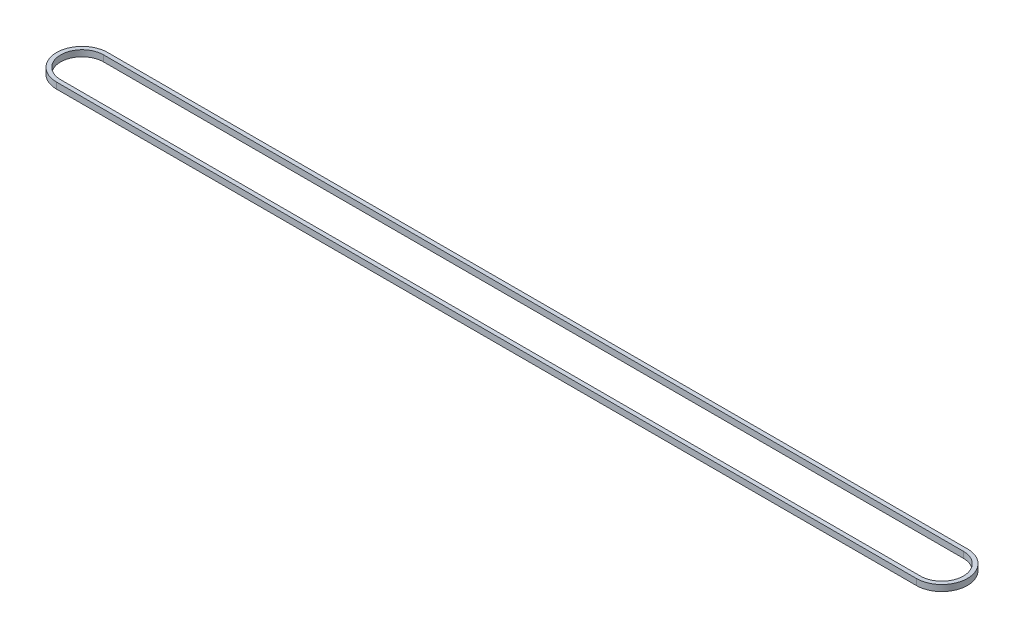
ISO-10303-21;
HEADER;
FILE_DESCRIPTION(('STEP AP214'),'2;1');
FILE_NAME('part.step','',(''),(''),'','','');
FILE_SCHEMA(('AUTOMOTIVE_DESIGN { 1 0 10303 214 1 1 1 1 }'));
ENDSEC;
DATA;
#1=APPLICATION_CONTEXT('core data for automotive mechanical design processes');
#2=APPLICATION_PROTOCOL_DEFINITION('international standard','automotive_design',2000,#1);
#3=PRODUCT_CONTEXT('',#1,'mechanical');
#4=PRODUCT('Part','Part','',(#3));
#5=PRODUCT_RELATED_PRODUCT_CATEGORY('part','',(#4));
#6=PRODUCT_DEFINITION_FORMATION('','',#4);
#7=PRODUCT_DEFINITION_CONTEXT('part definition',#1,'design');
#8=PRODUCT_DEFINITION('design','',#6,#7);
#9=PRODUCT_DEFINITION_SHAPE('','',#8);
#10=(LENGTH_UNIT() NAMED_UNIT(*) SI_UNIT(.MILLI.,.METRE.));
#11=(NAMED_UNIT(*) PLANE_ANGLE_UNIT() SI_UNIT($,.RADIAN.));
#12=(NAMED_UNIT(*) SI_UNIT($,.STERADIAN.) SOLID_ANGLE_UNIT());
#13=UNCERTAINTY_MEASURE_WITH_UNIT(LENGTH_MEASURE(1.E-05),#10,'distance_accuracy_value','');
#14=(GEOMETRIC_REPRESENTATION_CONTEXT(3) GLOBAL_UNCERTAINTY_ASSIGNED_CONTEXT((#13)) GLOBAL_UNIT_ASSIGNED_CONTEXT((#10,
#11,#12)) REPRESENTATION_CONTEXT('',''));
#15=CARTESIAN_POINT('',(0.,0.,0.));
#16=DIRECTION('',(0.,0.,1.));
#17=DIRECTION('',(1.,0.,0.));
#18=AXIS2_PLACEMENT_3D('',#15,#16,#17);
#19=CARTESIAN_POINT('',(-32.6689284068016,3.,0.));
#20=DIRECTION('',(0.,1.,0.));
#21=DIRECTION('',(0.,0.,1.));
#22=AXIS2_PLACEMENT_3D('',#19,#20,#21);
#23=PLANE('',#22);
#24=CARTESIAN_POINT('',(-32.6689284068016,3.,0.));
#25=DIRECTION('',(0.,1.,0.));
#26=DIRECTION('',(0.,0.,1.));
#27=AXIS2_PLACEMENT_3D('',#24,#25,#26);
#28=CIRCLE('',#27,12.5);
#29=CARTESIAN_POINT('',(-32.6689284068016,3.,-12.5));
#30=VERTEX_POINT('',#29);
#31=CARTESIAN_POINT('',(-32.6689284068016,3.,12.5));
#32=VERTEX_POINT('',#31);
#33=EDGE_CURVE('E134',#30,#32,#28,.T.);
#34=ORIENTED_EDGE('',*,*,#33,.T.);
#35=DIRECTION('',(1.,0.,0.));
#36=VECTOR('',#35,1.);
#37=CARTESIAN_POINT('',(-32.6689284068016,3.,12.5));
#38=LINE('',#37,#36);
#39=CARTESIAN_POINT('',(387.331071593198,3.,12.5));
#40=VERTEX_POINT('',#39);
#41=EDGE_CURVE('E137',#32,#40,#38,.T.);
#42=ORIENTED_EDGE('',*,*,#41,.T.);
#43=CARTESIAN_POINT('',(387.331071593198,3.,0.));
#44=DIRECTION('',(0.,1.,0.));
#45=DIRECTION('',(0.,0.,1.));
#46=AXIS2_PLACEMENT_3D('',#43,#44,#45);
#47=CIRCLE('',#46,12.5);
#48=CARTESIAN_POINT('',(387.331071593198,3.,-12.5));
#49=VERTEX_POINT('',#48);
#50=EDGE_CURVE('E140',#40,#49,#47,.T.);
#51=ORIENTED_EDGE('',*,*,#50,.T.);
#52=DIRECTION('',(-1.,0.,0.));
#53=VECTOR('',#52,1.);
#54=CARTESIAN_POINT('',(-32.6689284068016,3.,-12.5));
#55=LINE('',#54,#53);
#56=EDGE_CURVE('E142',#49,#30,#55,.T.);
#57=ORIENTED_EDGE('',*,*,#56,.T.);
#58=EDGE_LOOP('',(#34,#42,#51,#57));
#59=FACE_BOUND('',#58,.T.);
#60=DIRECTION('',(1.,0.,0.));
#61=VECTOR('',#60,1.);
#62=CARTESIAN_POINT('',(-32.6689284068016,3.,10.5));
#63=LINE('',#62,#61);
#64=CARTESIAN_POINT('',(-32.6689284068016,3.,10.5));
#65=VERTEX_POINT('',#64);
#66=CARTESIAN_POINT('',(387.331071593198,3.,10.5));
#67=VERTEX_POINT('',#66);
#68=EDGE_CURVE('E106',#65,#67,#63,.T.);
#69=ORIENTED_EDGE('',*,*,#68,.F.);
#70=CARTESIAN_POINT('',(-32.6689284068016,3.,0.));
#71=DIRECTION('',(0.,1.,0.));
#72=DIRECTION('',(0.,0.,1.));
#73=AXIS2_PLACEMENT_3D('',#70,#71,#72);
#74=CIRCLE('',#73,10.5);
#75=CARTESIAN_POINT('',(-32.6689284068016,3.,-10.5));
#76=VERTEX_POINT('',#75);
#77=EDGE_CURVE('E98',#76,#65,#74,.T.);
#78=ORIENTED_EDGE('',*,*,#77,.F.);
#79=DIRECTION('',(-1.,0.,0.));
#80=VECTOR('',#79,1.);
#81=CARTESIAN_POINT('',(-32.6689284068016,3.,-10.5));
#82=LINE('',#81,#80);
#83=CARTESIAN_POINT('',(387.331071593198,3.,-10.5));
#84=VERTEX_POINT('',#83);
#85=EDGE_CURVE('E120',#84,#76,#82,.T.);
#86=ORIENTED_EDGE('',*,*,#85,.F.);
#87=CARTESIAN_POINT('',(387.331071593198,3.,0.));
#88=DIRECTION('',(0.,1.,0.));
#89=DIRECTION('',(0.,0.,1.));
#90=AXIS2_PLACEMENT_3D('',#87,#88,#89);
#91=CIRCLE('',#90,10.5);
#92=EDGE_CURVE('E118',#67,#84,#91,.T.);
#93=ORIENTED_EDGE('',*,*,#92,.F.);
#94=EDGE_LOOP('',(#69,#78,#86,#93));
#95=FACE_BOUND('',#94,.T.);
#96=ADVANCED_FACE('F33',(#59,#95),#23,.T.);
#97=CARTESIAN_POINT('',(-32.6689284068016,0.,0.));
#98=DIRECTION('',(0.,1.,0.));
#99=DIRECTION('',(0.,0.,1.));
#100=AXIS2_PLACEMENT_3D('',#97,#98,#99);
#101=PLANE('',#100);
#102=CARTESIAN_POINT('',(-32.6689284068016,0.,0.));
#103=DIRECTION('',(0.,1.,0.));
#104=DIRECTION('',(0.,0.,1.));
#105=AXIS2_PLACEMENT_3D('',#102,#103,#104);
#106=CIRCLE('',#105,12.5);
#107=CARTESIAN_POINT('',(-32.6689284068016,0.,-12.5));
#108=VERTEX_POINT('',#107);
#109=CARTESIAN_POINT('',(-32.6689284068016,0.,12.5));
#110=VERTEX_POINT('',#109);
#111=EDGE_CURVE('E114',#108,#110,#106,.T.);
#112=ORIENTED_EDGE('',*,*,#111,.F.);
#113=DIRECTION('',(-1.,0.,0.));
#114=VECTOR('',#113,1.);
#115=CARTESIAN_POINT('',(-32.6689284068016,0.,-12.5));
#116=LINE('',#115,#114);
#117=CARTESIAN_POINT('',(387.331071593198,0.,-12.5));
#118=VERTEX_POINT('',#117);
#119=EDGE_CURVE('E138',#118,#108,#116,.T.);
#120=ORIENTED_EDGE('',*,*,#119,.F.);
#121=CARTESIAN_POINT('',(387.331071593198,0.,0.));
#122=DIRECTION('',(0.,1.,0.));
#123=DIRECTION('',(0.,0.,1.));
#124=AXIS2_PLACEMENT_3D('',#121,#122,#123);
#125=CIRCLE('',#124,12.5);
#126=CARTESIAN_POINT('',(387.331071593198,0.,12.5));
#127=VERTEX_POINT('',#126);
#128=EDGE_CURVE('E149',#127,#118,#125,.T.);
#129=ORIENTED_EDGE('',*,*,#128,.F.);
#130=DIRECTION('',(1.,0.,0.));
#131=VECTOR('',#130,1.);
#132=CARTESIAN_POINT('',(-32.6689284068016,0.,12.5));
#133=LINE('',#132,#131);
#134=EDGE_CURVE('E147',#110,#127,#133,.T.);
#135=ORIENTED_EDGE('',*,*,#134,.F.);
#136=EDGE_LOOP('',(#112,#120,#129,#135));
#137=FACE_BOUND('',#136,.T.);
#138=CARTESIAN_POINT('',(-32.6689284068016,0.,0.));
#139=DIRECTION('',(0.,1.,0.));
#140=DIRECTION('',(0.,0.,1.));
#141=AXIS2_PLACEMENT_3D('',#138,#139,#140);
#142=CIRCLE('',#141,10.5);
#143=CARTESIAN_POINT('',(-32.6689284068016,0.,-10.5));
#144=VERTEX_POINT('',#143);
#145=CARTESIAN_POINT('',(-32.6689284068016,0.,10.5));
#146=VERTEX_POINT('',#145);
#147=EDGE_CURVE('E56',#144,#146,#142,.T.);
#148=ORIENTED_EDGE('',*,*,#147,.T.);
#149=DIRECTION('',(1.,0.,0.));
#150=VECTOR('',#149,1.);
#151=CARTESIAN_POINT('',(-32.6689284068016,0.,10.5));
#152=LINE('',#151,#150);
#153=CARTESIAN_POINT('',(387.331071593198,0.,10.5));
#154=VERTEX_POINT('',#153);
#155=EDGE_CURVE('E113',#146,#154,#152,.T.);
#156=ORIENTED_EDGE('',*,*,#155,.T.);
#157=CARTESIAN_POINT('',(387.331071593198,0.,0.));
#158=DIRECTION('',(0.,1.,0.));
#159=DIRECTION('',(0.,0.,1.));
#160=AXIS2_PLACEMENT_3D('',#157,#158,#159);
#161=CIRCLE('',#160,10.5);
#162=CARTESIAN_POINT('',(387.331071593198,0.,-10.5));
#163=VERTEX_POINT('',#162);
#164=EDGE_CURVE('E126',#154,#163,#161,.T.);
#165=ORIENTED_EDGE('',*,*,#164,.T.);
#166=DIRECTION('',(-1.,0.,0.));
#167=VECTOR('',#166,1.);
#168=CARTESIAN_POINT('',(-32.6689284068016,0.,-10.5));
#169=LINE('',#168,#167);
#170=EDGE_CURVE('E107',#163,#144,#169,.T.);
#171=ORIENTED_EDGE('',*,*,#170,.T.);
#172=EDGE_LOOP('',(#148,#156,#165,#171));
#173=FACE_BOUND('',#172,.T.);
#174=ADVANCED_FACE('F167',(#137,#173),#101,.F.);
#175=CARTESIAN_POINT('',(-32.6689284068016,3.,0.));
#176=DIRECTION('',(0.,-1.,0.));
#177=DIRECTION('',(0.,0.,-1.));
#178=AXIS2_PLACEMENT_3D('',#175,#176,#177);
#179=CYLINDRICAL_SURFACE('',#178,12.5);
#180=ORIENTED_EDGE('',*,*,#111,.T.);
#181=DIRECTION('',(0.,-1.,0.));
#182=VECTOR('',#181,1.);
#183=CARTESIAN_POINT('',(-32.6689284068016,3.,12.5));
#184=LINE('',#183,#182);
#185=EDGE_CURVE('E11',#32,#110,#184,.T.);
#186=ORIENTED_EDGE('',*,*,#185,.F.);
#187=ORIENTED_EDGE('',*,*,#33,.F.);
#188=DIRECTION('',(0.,-1.,0.));
#189=VECTOR('',#188,1.);
#190=CARTESIAN_POINT('',(-32.6689284068016,3.,-12.5));
#191=LINE('',#190,#189);
#192=EDGE_CURVE('E144',#30,#108,#191,.T.);
#193=ORIENTED_EDGE('',*,*,#192,.T.);
#194=EDGE_LOOP('',(#180,#186,#187,#193));
#195=FACE_BOUND('',#194,.T.);
#196=ADVANCED_FACE('F35',(#195),#179,.T.);
#197=CARTESIAN_POINT('',(-32.6689284068016,3.,12.5));
#198=DIRECTION('',(0.,0.,-1.));
#199=DIRECTION('',(-1.,0.,0.));
#200=AXIS2_PLACEMENT_3D('',#197,#198,#199);
#201=PLANE('',#200);
#202=ORIENTED_EDGE('',*,*,#134,.T.);
#203=DIRECTION('',(0.,-1.,0.));
#204=VECTOR('',#203,1.);
#205=CARTESIAN_POINT('',(387.331071593198,3.,12.5));
#206=LINE('',#205,#204);
#207=EDGE_CURVE('E41',#40,#127,#206,.T.);
#208=ORIENTED_EDGE('',*,*,#207,.F.);
#209=ORIENTED_EDGE('',*,*,#41,.F.);
#210=ORIENTED_EDGE('',*,*,#185,.T.);
#211=EDGE_LOOP('',(#202,#208,#209,#210));
#212=FACE_BOUND('',#211,.T.);
#213=ADVANCED_FACE('F177',(#212),#201,.F.);
#214=CARTESIAN_POINT('',(387.331071593198,3.,0.));
#215=DIRECTION('',(0.,-1.,0.));
#216=DIRECTION('',(0.,0.,-1.));
#217=AXIS2_PLACEMENT_3D('',#214,#215,#216);
#218=CYLINDRICAL_SURFACE('',#217,12.5);
#219=ORIENTED_EDGE('',*,*,#128,.T.);
#220=DIRECTION('',(0.,-1.,0.));
#221=VECTOR('',#220,1.);
#222=CARTESIAN_POINT('',(387.331071593198,3.,-12.5));
#223=LINE('',#222,#221);
#224=EDGE_CURVE('E154',#49,#118,#223,.T.);
#225=ORIENTED_EDGE('',*,*,#224,.F.);
#226=ORIENTED_EDGE('',*,*,#50,.F.);
#227=ORIENTED_EDGE('',*,*,#207,.T.);
#228=EDGE_LOOP('',(#219,#225,#226,#227));
#229=FACE_BOUND('',#228,.T.);
#230=ADVANCED_FACE('F161',(#229),#218,.T.);
#231=CARTESIAN_POINT('',(-32.6689284068016,3.,-12.5));
#232=DIRECTION('',(0.,0.,1.));
#233=DIRECTION('',(1.,0.,0.));
#234=AXIS2_PLACEMENT_3D('',#231,#232,#233);
#235=PLANE('',#234);
#236=ORIENTED_EDGE('',*,*,#119,.T.);
#237=ORIENTED_EDGE('',*,*,#192,.F.);
#238=ORIENTED_EDGE('',*,*,#56,.F.);
#239=ORIENTED_EDGE('',*,*,#224,.T.);
#240=EDGE_LOOP('',(#236,#237,#238,#239));
#241=FACE_BOUND('',#240,.T.);
#242=ADVANCED_FACE('F171',(#241),#235,.F.);
#243=CARTESIAN_POINT('',(-32.6689284068016,3.,0.));
#244=DIRECTION('',(0.,-1.,0.));
#245=DIRECTION('',(0.,0.,-1.));
#246=AXIS2_PLACEMENT_3D('',#243,#244,#245);
#247=CYLINDRICAL_SURFACE('',#246,10.5);
#248=ORIENTED_EDGE('',*,*,#147,.F.);
#249=DIRECTION('',(0.,-1.,0.));
#250=VECTOR('',#249,1.);
#251=CARTESIAN_POINT('',(-32.6689284068016,3.,-10.5));
#252=LINE('',#251,#250);
#253=EDGE_CURVE('E102',#76,#144,#252,.T.);
#254=ORIENTED_EDGE('',*,*,#253,.F.);
#255=ORIENTED_EDGE('',*,*,#77,.T.);
#256=DIRECTION('',(0.,-1.,0.));
#257=VECTOR('',#256,1.);
#258=CARTESIAN_POINT('',(-32.6689284068016,3.,10.5));
#259=LINE('',#258,#257);
#260=EDGE_CURVE('E101',#65,#146,#259,.T.);
#261=ORIENTED_EDGE('',*,*,#260,.T.);
#262=EDGE_LOOP('',(#248,#254,#255,#261));
#263=FACE_BOUND('',#262,.T.);
#264=ADVANCED_FACE('F100',(#263),#247,.F.);
#265=CARTESIAN_POINT('',(-32.6689284068016,3.,10.5));
#266=DIRECTION('',(0.,0.,-1.));
#267=DIRECTION('',(-1.,0.,0.));
#268=AXIS2_PLACEMENT_3D('',#265,#266,#267);
#269=PLANE('',#268);
#270=ORIENTED_EDGE('',*,*,#155,.F.);
#271=ORIENTED_EDGE('',*,*,#260,.F.);
#272=ORIENTED_EDGE('',*,*,#68,.T.);
#273=DIRECTION('',(0.,-1.,0.));
#274=VECTOR('',#273,1.);
#275=CARTESIAN_POINT('',(387.331071593198,3.,10.5));
#276=LINE('',#275,#274);
#277=EDGE_CURVE('E115',#67,#154,#276,.T.);
#278=ORIENTED_EDGE('',*,*,#277,.T.);
#279=EDGE_LOOP('',(#270,#271,#272,#278));
#280=FACE_BOUND('',#279,.T.);
#281=ADVANCED_FACE('F110',(#280),#269,.T.);
#282=CARTESIAN_POINT('',(387.331071593198,3.,0.));
#283=DIRECTION('',(0.,-1.,0.));
#284=DIRECTION('',(0.,0.,-1.));
#285=AXIS2_PLACEMENT_3D('',#282,#283,#284);
#286=CYLINDRICAL_SURFACE('',#285,10.5);
#287=ORIENTED_EDGE('',*,*,#164,.F.);
#288=ORIENTED_EDGE('',*,*,#277,.F.);
#289=ORIENTED_EDGE('',*,*,#92,.T.);
#290=DIRECTION('',(0.,-1.,0.));
#291=VECTOR('',#290,1.);
#292=CARTESIAN_POINT('',(387.331071593198,3.,-10.5));
#293=LINE('',#292,#291);
#294=EDGE_CURVE('E48',#84,#163,#293,.T.);
#295=ORIENTED_EDGE('',*,*,#294,.T.);
#296=EDGE_LOOP('',(#287,#288,#289,#295));
#297=FACE_BOUND('',#296,.T.);
#298=ADVANCED_FACE('F200',(#297),#286,.F.);
#299=CARTESIAN_POINT('',(-32.6689284068016,3.,-10.5));
#300=DIRECTION('',(0.,0.,1.));
#301=DIRECTION('',(1.,0.,0.));
#302=AXIS2_PLACEMENT_3D('',#299,#300,#301);
#303=PLANE('',#302);
#304=ORIENTED_EDGE('',*,*,#170,.F.);
#305=ORIENTED_EDGE('',*,*,#294,.F.);
#306=ORIENTED_EDGE('',*,*,#85,.T.);
#307=ORIENTED_EDGE('',*,*,#253,.T.);
#308=EDGE_LOOP('',(#304,#305,#306,#307));
#309=FACE_BOUND('',#308,.T.);
#310=ADVANCED_FACE('F204',(#309),#303,.T.);
#311=CLOSED_SHELL('',(#96,#174,#196,#213,#230,#242,#264,#281,#298,#310));
#312=MANIFOLD_SOLID_BREP('B2',#311);
#313=ADVANCED_BREP_SHAPE_REPRESENTATION('',(#18,#312),#14);
#314=SHAPE_DEFINITION_REPRESENTATION(#9,#313);
ENDSEC;
END-ISO-10303-21;
